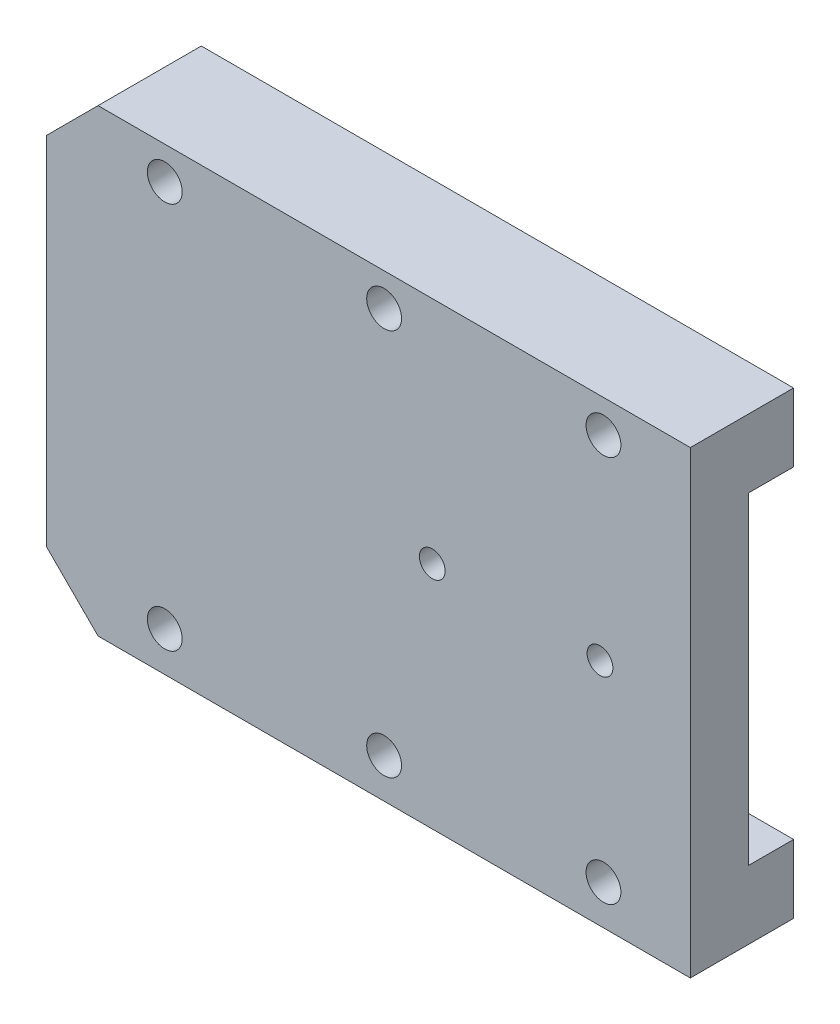
ISO-10303-21;
HEADER;
FILE_DESCRIPTION(('STEP AP214'),'2;1');
FILE_NAME('part.step','',(''),(''),'','','');
FILE_SCHEMA(('AUTOMOTIVE_DESIGN { 1 0 10303 214 1 1 1 1 }'));
ENDSEC;
DATA;
#1=APPLICATION_CONTEXT('core data for automotive mechanical design processes');
#2=APPLICATION_PROTOCOL_DEFINITION('international standard','automotive_design',2000,#1);
#3=PRODUCT_CONTEXT('',#1,'mechanical');
#4=PRODUCT('Part','Part','',(#3));
#5=PRODUCT_RELATED_PRODUCT_CATEGORY('part','',(#4));
#6=PRODUCT_DEFINITION_FORMATION('','',#4);
#7=PRODUCT_DEFINITION_CONTEXT('part definition',#1,'design');
#8=PRODUCT_DEFINITION('design','',#6,#7);
#9=PRODUCT_DEFINITION_SHAPE('','',#8);
#10=(LENGTH_UNIT() NAMED_UNIT(*) SI_UNIT(.MILLI.,.METRE.));
#11=(NAMED_UNIT(*) PLANE_ANGLE_UNIT() SI_UNIT($,.RADIAN.));
#12=(NAMED_UNIT(*) SI_UNIT($,.STERADIAN.) SOLID_ANGLE_UNIT());
#13=UNCERTAINTY_MEASURE_WITH_UNIT(LENGTH_MEASURE(1.E-05),#10,'distance_accuracy_value','');
#14=(GEOMETRIC_REPRESENTATION_CONTEXT(3) GLOBAL_UNCERTAINTY_ASSIGNED_CONTEXT((#13)) GLOBAL_UNIT_ASSIGNED_CONTEXT((#10,
#11,#12)) REPRESENTATION_CONTEXT('',''));
#15=CARTESIAN_POINT('',(0.,0.,0.));
#16=DIRECTION('',(0.,0.,1.));
#17=DIRECTION('',(1.,0.,0.));
#18=AXIS2_PLACEMENT_3D('',#15,#16,#17);
#19=CARTESIAN_POINT('',(0.,0.,-4.));
#20=DIRECTION('',(0.,0.,-1.));
#21=DIRECTION('',(-1.,0.,0.));
#22=AXIS2_PLACEMENT_3D('',#19,#20,#21);
#23=PLANE('',#22);
#24=DIRECTION('',(-1.,0.,0.));
#25=VECTOR('',#24,1.);
#26=CARTESIAN_POINT('',(22.5,12.5,-4.));
#27=LINE('',#26,#25);
#28=CARTESIAN_POINT('',(22.5,12.5,-4.));
#29=VERTEX_POINT('',#28);
#30=CARTESIAN_POINT('',(-27.4,12.5,-4.));
#31=VERTEX_POINT('',#30);
#32=EDGE_CURVE('E170',#29,#31,#27,.T.);
#33=ORIENTED_EDGE('',*,*,#32,.T.);
#34=DIRECTION('',(0.,1.,0.));
#35=VECTOR('',#34,1.);
#36=CARTESIAN_POINT('',(-27.4,17.8,-4.));
#37=LINE('',#36,#35);
#38=CARTESIAN_POINT('',(-27.4,13.8,-4.));
#39=VERTEX_POINT('',#38);
#40=EDGE_CURVE('E173',#31,#39,#37,.T.);
#41=ORIENTED_EDGE('',*,*,#40,.T.);
#42=DIRECTION('',(0.707106781186549,0.707106781186546,0.));
#43=VECTOR('',#42,1.);
#44=CARTESIAN_POINT('',(-20.6,20.6,-4.));
#45=LINE('',#44,#43);
#46=CARTESIAN_POINT('',(-23.4,17.8,-4.));
#47=VERTEX_POINT('',#46);
#48=EDGE_CURVE('E143',#39,#47,#45,.T.);
#49=ORIENTED_EDGE('',*,*,#48,.T.);
#50=DIRECTION('',(-1.,0.,0.));
#51=VECTOR('',#50,1.);
#52=CARTESIAN_POINT('',(22.5,17.8,-4.));
#53=LINE('',#52,#51);
#54=CARTESIAN_POINT('',(22.5,17.8,-4.));
#55=VERTEX_POINT('',#54);
#56=EDGE_CURVE('E121',#55,#47,#53,.T.);
#57=ORIENTED_EDGE('',*,*,#56,.F.);
#58=DIRECTION('',(0.,1.,0.));
#59=VECTOR('',#58,1.);
#60=CARTESIAN_POINT('',(22.5,17.8,-4.));
#61=LINE('',#60,#59);
#62=EDGE_CURVE('E122',#29,#55,#61,.T.);
#63=ORIENTED_EDGE('',*,*,#62,.F.);
#64=EDGE_LOOP('',(#33,#41,#49,#57,#63));
#65=FACE_BOUND('',#64,.T.);
#66=CARTESIAN_POINT('',(-18.2306151546301,15.26709885284,-4.));
#67=DIRECTION('',(0.,0.,-1.));
#68=DIRECTION('',(-1.,0.,0.));
#69=AXIS2_PLACEMENT_3D('',#66,#67,#68);
#70=CIRCLE('',#69,1.35);
#71=CARTESIAN_POINT('',(-19.5806151546301,15.26709885284,-4.));
#72=VERTEX_POINT('',#71);
#73=EDGE_CURVE('E190',#72,#72,#70,.T.);
#74=ORIENTED_EDGE('',*,*,#73,.F.);
#75=EDGE_LOOP('',(#74));
#76=FACE_BOUND('',#75,.T.);
#77=CARTESIAN_POINT('',(-1.23061515463011,15.2670988528399,-4.));
#78=DIRECTION('',(0.,0.,-1.));
#79=DIRECTION('',(-1.,0.,0.));
#80=AXIS2_PLACEMENT_3D('',#77,#78,#79);
#81=CIRCLE('',#80,1.35);
#82=CARTESIAN_POINT('',(-2.58061515463011,15.2670988528399,-4.));
#83=VERTEX_POINT('',#82);
#84=EDGE_CURVE('E184',#83,#83,#81,.T.);
#85=ORIENTED_EDGE('',*,*,#84,.F.);
#86=EDGE_LOOP('',(#85));
#87=FACE_BOUND('',#86,.T.);
#88=CARTESIAN_POINT('',(15.7693848453699,15.2670988528398,-4.));
#89=DIRECTION('',(0.,0.,-1.));
#90=DIRECTION('',(-1.,0.,0.));
#91=AXIS2_PLACEMENT_3D('',#88,#89,#90);
#92=CIRCLE('',#91,1.35);
#93=CARTESIAN_POINT('',(14.4193848453699,15.2670988528398,-4.));
#94=VERTEX_POINT('',#93);
#95=EDGE_CURVE('E179',#94,#94,#92,.T.);
#96=ORIENTED_EDGE('',*,*,#95,.F.);
#97=EDGE_LOOP('',(#96));
#98=FACE_BOUND('',#97,.T.);
#99=ADVANCED_FACE('F16',(#65,#76,#87,#98),#23,.T.);
#100=CARTESIAN_POINT('',(22.5,-17.8,4.));
#101=DIRECTION('',(0.,1.,0.));
#102=DIRECTION('',(-1.,0.,0.));
#103=AXIS2_PLACEMENT_3D('',#100,#101,#102);
#104=PLANE('',#103);
#105=DIRECTION('',(1.,0.,0.));
#106=VECTOR('',#105,1.);
#107=CARTESIAN_POINT('',(22.5,-17.8,4.));
#108=LINE('',#107,#106);
#109=CARTESIAN_POINT('',(-23.4,-17.8,4.));
#110=VERTEX_POINT('',#109);
#111=CARTESIAN_POINT('',(22.5,-17.8,4.));
#112=VERTEX_POINT('',#111);
#113=EDGE_CURVE('E125',#110,#112,#108,.T.);
#114=ORIENTED_EDGE('',*,*,#113,.F.);
#115=DIRECTION('',(0.,0.,-1.));
#116=VECTOR('',#115,1.);
#117=CARTESIAN_POINT('',(-23.4,-17.8,-4.));
#118=LINE('',#117,#116);
#119=CARTESIAN_POINT('',(-23.4,-17.8,-4.));
#120=VERTEX_POINT('',#119);
#121=EDGE_CURVE('E10',#110,#120,#118,.T.);
#122=ORIENTED_EDGE('',*,*,#121,.T.);
#123=DIRECTION('',(1.,0.,0.));
#124=VECTOR('',#123,1.);
#125=CARTESIAN_POINT('',(22.5,-17.8,-4.));
#126=LINE('',#125,#124);
#127=CARTESIAN_POINT('',(22.5,-17.8,-4.));
#128=VERTEX_POINT('',#127);
#129=EDGE_CURVE('E127',#120,#128,#126,.T.);
#130=ORIENTED_EDGE('',*,*,#129,.T.);
#131=DIRECTION('',(0.,0.,-1.));
#132=VECTOR('',#131,1.);
#133=CARTESIAN_POINT('',(22.5,-17.8,4.));
#134=LINE('',#133,#132);
#135=EDGE_CURVE('E120',#112,#128,#134,.T.);
#136=ORIENTED_EDGE('',*,*,#135,.F.);
#137=EDGE_LOOP('',(#114,#122,#130,#136));
#138=FACE_BOUND('',#137,.T.);
#139=ADVANCED_FACE('F238',(#138),#104,.F.);
#140=CARTESIAN_POINT('',(22.5,17.8,4.));
#141=DIRECTION('',(-1.,0.,0.));
#142=DIRECTION('',(0.,0.,1.));
#143=AXIS2_PLACEMENT_3D('',#140,#141,#142);
#144=PLANE('',#143);
#145=DIRECTION('',(0.,1.,0.));
#146=VECTOR('',#145,1.);
#147=CARTESIAN_POINT('',(22.5,12.5,-0.5));
#148=LINE('',#147,#146);
#149=CARTESIAN_POINT('',(22.5,-12.5,-0.5));
#150=VERTEX_POINT('',#149);
#151=CARTESIAN_POINT('',(22.5,12.5,-0.5));
#152=VERTEX_POINT('',#151);
#153=EDGE_CURVE('E102',#150,#152,#148,.T.);
#154=ORIENTED_EDGE('',*,*,#153,.T.);
#155=DIRECTION('',(0.,0.,-1.));
#156=VECTOR('',#155,1.);
#157=CARTESIAN_POINT('',(22.5,12.5,-0.5));
#158=LINE('',#157,#156);
#159=EDGE_CURVE('E114',#152,#29,#158,.T.);
#160=ORIENTED_EDGE('',*,*,#159,.T.);
#161=ORIENTED_EDGE('',*,*,#62,.T.);
#162=DIRECTION('',(0.,0.,-1.));
#163=VECTOR('',#162,1.);
#164=CARTESIAN_POINT('',(22.5,17.8,4.));
#165=LINE('',#164,#163);
#166=CARTESIAN_POINT('',(22.5,17.8,4.));
#167=VERTEX_POINT('',#166);
#168=EDGE_CURVE('E131',#167,#55,#165,.T.);
#169=ORIENTED_EDGE('',*,*,#168,.F.);
#170=DIRECTION('',(0.,1.,0.));
#171=VECTOR('',#170,1.);
#172=CARTESIAN_POINT('',(22.5,17.8,4.));
#173=LINE('',#172,#171);
#174=EDGE_CURVE('E217',#112,#167,#173,.T.);
#175=ORIENTED_EDGE('',*,*,#174,.F.);
#176=ORIENTED_EDGE('',*,*,#135,.T.);
#177=CARTESIAN_POINT('',(22.5,-12.5,-4.));
#178=VERTEX_POINT('',#177);
#179=EDGE_CURVE('E111',#128,#178,#61,.T.);
#180=ORIENTED_EDGE('',*,*,#179,.T.);
#181=DIRECTION('',(0.,0.,1.));
#182=VECTOR('',#181,1.);
#183=CARTESIAN_POINT('',(22.5,-12.5,-0.5));
#184=LINE('',#183,#182);
#185=EDGE_CURVE('E95',#178,#150,#184,.T.);
#186=ORIENTED_EDGE('',*,*,#185,.T.);
#187=EDGE_LOOP('',(#154,#160,#161,#169,#175,#176,#180,#186));
#188=FACE_BOUND('',#187,.T.);
#189=ADVANCED_FACE('F117',(#188),#144,.F.);
#190=CARTESIAN_POINT('',(22.5,17.8,4.));
#191=DIRECTION('',(0.,-1.,0.));
#192=DIRECTION('',(1.,0.,0.));
#193=AXIS2_PLACEMENT_3D('',#190,#191,#192);
#194=PLANE('',#193);
#195=ORIENTED_EDGE('',*,*,#56,.T.);
#196=DIRECTION('',(0.,0.,1.));
#197=VECTOR('',#196,1.);
#198=CARTESIAN_POINT('',(-23.4,17.8,4.));
#199=LINE('',#198,#197);
#200=CARTESIAN_POINT('',(-23.4,17.8,4.));
#201=VERTEX_POINT('',#200);
#202=EDGE_CURVE('E145',#47,#201,#199,.T.);
#203=ORIENTED_EDGE('',*,*,#202,.T.);
#204=DIRECTION('',(-1.,0.,0.));
#205=VECTOR('',#204,1.);
#206=CARTESIAN_POINT('',(22.5,17.8,4.));
#207=LINE('',#206,#205);
#208=EDGE_CURVE('E134',#167,#201,#207,.T.);
#209=ORIENTED_EDGE('',*,*,#208,.F.);
#210=ORIENTED_EDGE('',*,*,#168,.T.);
#211=EDGE_LOOP('',(#195,#203,#209,#210));
#212=FACE_BOUND('',#211,.T.);
#213=ADVANCED_FACE('F248',(#212),#194,.F.);
#214=CARTESIAN_POINT('',(0.,0.,4.));
#215=DIRECTION('',(0.,0.,-1.));
#216=DIRECTION('',(-1.,0.,0.));
#217=AXIS2_PLACEMENT_3D('',#214,#215,#216);
#218=PLANE('',#217);
#219=CARTESIAN_POINT('',(15.5,0.,4.));
#220=DIRECTION('',(0.,0.,1.));
#221=DIRECTION('',(1.,0.,0.));
#222=AXIS2_PLACEMENT_3D('',#219,#220,#221);
#223=CIRCLE('',#222,1.);
#224=CARTESIAN_POINT('',(16.5,0.,4.));
#225=VERTEX_POINT('',#224);
#226=EDGE_CURVE('E161',#225,#225,#223,.T.);
#227=ORIENTED_EDGE('',*,*,#226,.F.);
#228=EDGE_LOOP('',(#227));
#229=FACE_BOUND('',#228,.T.);
#230=CARTESIAN_POINT('',(2.5,0.,4.));
#231=DIRECTION('',(0.,0.,1.));
#232=DIRECTION('',(1.,0.,0.));
#233=AXIS2_PLACEMENT_3D('',#230,#231,#232);
#234=CIRCLE('',#233,1.);
#235=CARTESIAN_POINT('',(3.5,0.,4.));
#236=VERTEX_POINT('',#235);
#237=EDGE_CURVE('E151',#236,#236,#234,.T.);
#238=ORIENTED_EDGE('',*,*,#237,.F.);
#239=EDGE_LOOP('',(#238));
#240=FACE_BOUND('',#239,.T.);
#241=CARTESIAN_POINT('',(15.7693848453699,15.2670988528398,4.));
#242=DIRECTION('',(0.,0.,-1.));
#243=DIRECTION('',(-1.,0.,0.));
#244=AXIS2_PLACEMENT_3D('',#241,#242,#243);
#245=CIRCLE('',#244,1.35);
#246=CARTESIAN_POINT('',(14.4193848453699,15.2670988528398,4.));
#247=VERTEX_POINT('',#246);
#248=EDGE_CURVE('E181',#247,#247,#245,.T.);
#249=ORIENTED_EDGE('',*,*,#248,.T.);
#250=EDGE_LOOP('',(#249));
#251=FACE_BOUND('',#250,.T.);
#252=CARTESIAN_POINT('',(-1.23061515463011,15.2670988528399,4.));
#253=DIRECTION('',(0.,0.,-1.));
#254=DIRECTION('',(-1.,0.,0.));
#255=AXIS2_PLACEMENT_3D('',#252,#253,#254);
#256=CIRCLE('',#255,1.35);
#257=CARTESIAN_POINT('',(-2.58061515463011,15.2670988528399,4.));
#258=VERTEX_POINT('',#257);
#259=EDGE_CURVE('E187',#258,#258,#256,.T.);
#260=ORIENTED_EDGE('',*,*,#259,.T.);
#261=EDGE_LOOP('',(#260));
#262=FACE_BOUND('',#261,.T.);
#263=CARTESIAN_POINT('',(-18.2306151546301,15.26709885284,4.));
#264=DIRECTION('',(0.,0.,-1.));
#265=DIRECTION('',(-1.,0.,0.));
#266=AXIS2_PLACEMENT_3D('',#263,#264,#265);
#267=CIRCLE('',#266,1.35);
#268=CARTESIAN_POINT('',(-19.5806151546301,15.26709885284,4.));
#269=VERTEX_POINT('',#268);
#270=EDGE_CURVE('E193',#269,#269,#267,.T.);
#271=ORIENTED_EDGE('',*,*,#270,.T.);
#272=EDGE_LOOP('',(#271));
#273=FACE_BOUND('',#272,.T.);
#274=CARTESIAN_POINT('',(-18.2306151546302,-14.7329011471601,4.));
#275=DIRECTION('',(0.,0.,-1.));
#276=DIRECTION('',(-1.,0.,0.));
#277=AXIS2_PLACEMENT_3D('',#274,#275,#276);
#278=CIRCLE('',#277,1.35);
#279=CARTESIAN_POINT('',(-19.5806151546302,-14.7329011471601,4.));
#280=VERTEX_POINT('',#279);
#281=EDGE_CURVE('E199',#280,#280,#278,.T.);
#282=ORIENTED_EDGE('',*,*,#281,.T.);
#283=EDGE_LOOP('',(#282));
#284=FACE_BOUND('',#283,.T.);
#285=CARTESIAN_POINT('',(-1.23061515463022,-14.7329011471601,4.));
#286=DIRECTION('',(0.,0.,-1.));
#287=DIRECTION('',(-1.,0.,0.));
#288=AXIS2_PLACEMENT_3D('',#285,#286,#287);
#289=CIRCLE('',#288,1.35);
#290=CARTESIAN_POINT('',(-2.58061515463022,-14.7329011471601,4.));
#291=VERTEX_POINT('',#290);
#292=EDGE_CURVE('E205',#291,#291,#289,.T.);
#293=ORIENTED_EDGE('',*,*,#292,.T.);
#294=EDGE_LOOP('',(#293));
#295=FACE_BOUND('',#294,.T.);
#296=CARTESIAN_POINT('',(15.7693848453698,-14.7329011471602,4.));
#297=DIRECTION('',(0.,0.,-1.));
#298=DIRECTION('',(-1.,0.,0.));
#299=AXIS2_PLACEMENT_3D('',#296,#297,#298);
#300=CIRCLE('',#299,1.35);
#301=CARTESIAN_POINT('',(14.4193848453698,-14.7329011471602,4.));
#302=VERTEX_POINT('',#301);
#303=EDGE_CURVE('E211',#302,#302,#300,.T.);
#304=ORIENTED_EDGE('',*,*,#303,.T.);
#305=EDGE_LOOP('',(#304));
#306=FACE_BOUND('',#305,.T.);
#307=ORIENTED_EDGE('',*,*,#208,.T.);
#308=DIRECTION('',(-0.707106781186549,-0.707106781186546,0.));
#309=VECTOR('',#308,1.);
#310=CARTESIAN_POINT('',(-27.4,13.8,4.));
#311=LINE('',#310,#309);
#312=CARTESIAN_POINT('',(-27.4,13.8,4.));
#313=VERTEX_POINT('',#312);
#314=EDGE_CURVE('E25',#201,#313,#311,.T.);
#315=ORIENTED_EDGE('',*,*,#314,.T.);
#316=DIRECTION('',(0.,-1.,0.));
#317=VECTOR('',#316,1.);
#318=CARTESIAN_POINT('',(-27.4,17.8,4.));
#319=LINE('',#318,#317);
#320=CARTESIAN_POINT('',(-27.4,-13.8,4.));
#321=VERTEX_POINT('',#320);
#322=EDGE_CURVE('E177',#313,#321,#319,.T.);
#323=ORIENTED_EDGE('',*,*,#322,.T.);
#324=DIRECTION('',(0.707106781186547,-0.707106781186548,0.));
#325=VECTOR('',#324,1.);
#326=CARTESIAN_POINT('',(-23.4,-17.8,4.));
#327=LINE('',#326,#325);
#328=EDGE_CURVE('E41',#321,#110,#327,.T.);
#329=ORIENTED_EDGE('',*,*,#328,.T.);
#330=ORIENTED_EDGE('',*,*,#113,.T.);
#331=ORIENTED_EDGE('',*,*,#174,.T.);
#332=EDGE_LOOP('',(#307,#315,#323,#329,#330,#331));
#333=FACE_BOUND('',#332,.T.);
#334=ADVANCED_FACE('F221',(#229,#240,#251,#262,#273,#284,#295,#306,#333),#218,.F.);
#335=DIRECTION('',(-1.,0.,0.));
#336=VECTOR('',#335,1.);
#337=CARTESIAN_POINT('',(22.5,-12.5,-4.));
#338=LINE('',#337,#336);
#339=CARTESIAN_POINT('',(-27.4,-12.5,-4.));
#340=VERTEX_POINT('',#339);
#341=EDGE_CURVE('E33',#178,#340,#338,.T.);
#342=ORIENTED_EDGE('',*,*,#341,.F.);
#343=ORIENTED_EDGE('',*,*,#179,.F.);
#344=ORIENTED_EDGE('',*,*,#129,.F.);
#345=DIRECTION('',(-0.707106781186547,0.707106781186548,0.));
#346=VECTOR('',#345,1.);
#347=CARTESIAN_POINT('',(-20.6,-20.6,-4.));
#348=LINE('',#347,#346);
#349=CARTESIAN_POINT('',(-27.4,-13.8,-4.));
#350=VERTEX_POINT('',#349);
#351=EDGE_CURVE('E141',#120,#350,#348,.T.);
#352=ORIENTED_EDGE('',*,*,#351,.T.);
#353=EDGE_CURVE('E113',#350,#340,#37,.T.);
#354=ORIENTED_EDGE('',*,*,#353,.T.);
#355=EDGE_LOOP('',(#342,#343,#344,#352,#354));
#356=FACE_BOUND('',#355,.T.);
#357=CARTESIAN_POINT('',(-18.2306151546302,-14.7329011471601,-4.));
#358=DIRECTION('',(0.,0.,-1.));
#359=DIRECTION('',(-1.,0.,0.));
#360=AXIS2_PLACEMENT_3D('',#357,#358,#359);
#361=CIRCLE('',#360,1.35);
#362=CARTESIAN_POINT('',(-19.5806151546302,-14.7329011471601,-4.));
#363=VERTEX_POINT('',#362);
#364=EDGE_CURVE('E196',#363,#363,#361,.T.);
#365=ORIENTED_EDGE('',*,*,#364,.F.);
#366=EDGE_LOOP('',(#365));
#367=FACE_BOUND('',#366,.T.);
#368=CARTESIAN_POINT('',(-1.23061515463022,-14.7329011471601,-4.));
#369=DIRECTION('',(0.,0.,-1.));
#370=DIRECTION('',(-1.,0.,0.));
#371=AXIS2_PLACEMENT_3D('',#368,#369,#370);
#372=CIRCLE('',#371,1.35);
#373=CARTESIAN_POINT('',(-2.58061515463022,-14.7329011471601,-4.));
#374=VERTEX_POINT('',#373);
#375=EDGE_CURVE('E202',#374,#374,#372,.T.);
#376=ORIENTED_EDGE('',*,*,#375,.F.);
#377=EDGE_LOOP('',(#376));
#378=FACE_BOUND('',#377,.T.);
#379=CARTESIAN_POINT('',(15.7693848453698,-14.7329011471602,-4.));
#380=DIRECTION('',(0.,0.,-1.));
#381=DIRECTION('',(-1.,0.,0.));
#382=AXIS2_PLACEMENT_3D('',#379,#380,#381);
#383=CIRCLE('',#382,1.35);
#384=CARTESIAN_POINT('',(14.4193848453698,-14.7329011471602,-4.));
#385=VERTEX_POINT('',#384);
#386=EDGE_CURVE('E208',#385,#385,#383,.T.);
#387=ORIENTED_EDGE('',*,*,#386,.F.);
#388=EDGE_LOOP('',(#387));
#389=FACE_BOUND('',#388,.T.);
#390=ADVANCED_FACE('F108',(#356,#367,#378,#389),#23,.T.);
#391=CARTESIAN_POINT('',(15.7693848453698,-14.7329011471602,4.));
#392=DIRECTION('',(0.,0.,-1.));
#393=DIRECTION('',(-1.,0.,0.));
#394=AXIS2_PLACEMENT_3D('',#391,#392,#393);
#395=CYLINDRICAL_SURFACE('',#394,1.35);
#396=ORIENTED_EDGE('',*,*,#303,.F.);
#397=EDGE_LOOP('',(#396));
#398=FACE_BOUND('',#397,.T.);
#399=ORIENTED_EDGE('',*,*,#386,.T.);
#400=EDGE_LOOP('',(#399));
#401=FACE_BOUND('',#400,.T.);
#402=ADVANCED_FACE('F268',(#398,#401),#395,.F.);
#403=CARTESIAN_POINT('',(-1.23061515463022,-14.7329011471601,4.));
#404=DIRECTION('',(0.,0.,-1.));
#405=DIRECTION('',(-1.,0.,0.));
#406=AXIS2_PLACEMENT_3D('',#403,#404,#405);
#407=CYLINDRICAL_SURFACE('',#406,1.35);
#408=ORIENTED_EDGE('',*,*,#292,.F.);
#409=EDGE_LOOP('',(#408));
#410=FACE_BOUND('',#409,.T.);
#411=ORIENTED_EDGE('',*,*,#375,.T.);
#412=EDGE_LOOP('',(#411));
#413=FACE_BOUND('',#412,.T.);
#414=ADVANCED_FACE('F273',(#410,#413),#407,.F.);
#415=CARTESIAN_POINT('',(-18.2306151546302,-14.7329011471601,4.));
#416=DIRECTION('',(0.,0.,-1.));
#417=DIRECTION('',(-1.,0.,0.));
#418=AXIS2_PLACEMENT_3D('',#415,#416,#417);
#419=CYLINDRICAL_SURFACE('',#418,1.35);
#420=ORIENTED_EDGE('',*,*,#281,.F.);
#421=EDGE_LOOP('',(#420));
#422=FACE_BOUND('',#421,.T.);
#423=ORIENTED_EDGE('',*,*,#364,.T.);
#424=EDGE_LOOP('',(#423));
#425=FACE_BOUND('',#424,.T.);
#426=ADVANCED_FACE('F280',(#422,#425),#419,.F.);
#427=CARTESIAN_POINT('',(-18.2306151546301,15.26709885284,4.));
#428=DIRECTION('',(0.,0.,-1.));
#429=DIRECTION('',(-1.,0.,0.));
#430=AXIS2_PLACEMENT_3D('',#427,#428,#429);
#431=CYLINDRICAL_SURFACE('',#430,1.35);
#432=ORIENTED_EDGE('',*,*,#270,.F.);
#433=EDGE_LOOP('',(#432));
#434=FACE_BOUND('',#433,.T.);
#435=ORIENTED_EDGE('',*,*,#73,.T.);
#436=EDGE_LOOP('',(#435));
#437=FACE_BOUND('',#436,.T.);
#438=ADVANCED_FACE('F288',(#434,#437),#431,.F.);
#439=CARTESIAN_POINT('',(-1.23061515463011,15.2670988528399,4.));
#440=DIRECTION('',(0.,0.,-1.));
#441=DIRECTION('',(-1.,0.,0.));
#442=AXIS2_PLACEMENT_3D('',#439,#440,#441);
#443=CYLINDRICAL_SURFACE('',#442,1.35);
#444=ORIENTED_EDGE('',*,*,#259,.F.);
#445=EDGE_LOOP('',(#444));
#446=FACE_BOUND('',#445,.T.);
#447=ORIENTED_EDGE('',*,*,#84,.T.);
#448=EDGE_LOOP('',(#447));
#449=FACE_BOUND('',#448,.T.);
#450=ADVANCED_FACE('F292',(#446,#449),#443,.F.);
#451=CARTESIAN_POINT('',(15.7693848453699,15.2670988528398,4.));
#452=DIRECTION('',(0.,0.,-1.));
#453=DIRECTION('',(-1.,0.,0.));
#454=AXIS2_PLACEMENT_3D('',#451,#452,#453);
#455=CYLINDRICAL_SURFACE('',#454,1.35);
#456=ORIENTED_EDGE('',*,*,#248,.F.);
#457=EDGE_LOOP('',(#456));
#458=FACE_BOUND('',#457,.T.);
#459=ORIENTED_EDGE('',*,*,#95,.T.);
#460=EDGE_LOOP('',(#459));
#461=FACE_BOUND('',#460,.T.);
#462=ADVANCED_FACE('F296',(#458,#461),#455,.F.);
#463=CARTESIAN_POINT('',(-27.4,17.8,39.9356369082281));
#464=DIRECTION('',(-1.,0.,0.));
#465=DIRECTION('',(0.,-1.,0.));
#466=AXIS2_PLACEMENT_3D('',#463,#464,#465);
#467=PLANE('',#466);
#468=DIRECTION('',(0.,0.,-1.));
#469=VECTOR('',#468,1.);
#470=CARTESIAN_POINT('',(-27.4,12.5,-0.5));
#471=LINE('',#470,#469);
#472=CARTESIAN_POINT('',(-27.4,12.5,-0.5));
#473=VERTEX_POINT('',#472);
#474=EDGE_CURVE('E103',#473,#31,#471,.T.);
#475=ORIENTED_EDGE('',*,*,#474,.F.);
#476=DIRECTION('',(0.,1.,0.));
#477=VECTOR('',#476,1.);
#478=CARTESIAN_POINT('',(-27.4,12.5,-0.5));
#479=LINE('',#478,#477);
#480=CARTESIAN_POINT('',(-27.4,-12.5,-0.5));
#481=VERTEX_POINT('',#480);
#482=EDGE_CURVE('E154',#481,#473,#479,.T.);
#483=ORIENTED_EDGE('',*,*,#482,.F.);
#484=DIRECTION('',(0.,0.,1.));
#485=VECTOR('',#484,1.);
#486=CARTESIAN_POINT('',(-27.4,-12.5,-0.5));
#487=LINE('',#486,#485);
#488=EDGE_CURVE('E150',#340,#481,#487,.T.);
#489=ORIENTED_EDGE('',*,*,#488,.F.);
#490=ORIENTED_EDGE('',*,*,#353,.F.);
#491=DIRECTION('',(0.,0.,1.));
#492=VECTOR('',#491,1.);
#493=CARTESIAN_POINT('',(-27.4,-13.8,4.));
#494=LINE('',#493,#492);
#495=EDGE_CURVE('E136',#350,#321,#494,.T.);
#496=ORIENTED_EDGE('',*,*,#495,.T.);
#497=ORIENTED_EDGE('',*,*,#322,.F.);
#498=DIRECTION('',(0.,0.,-1.));
#499=VECTOR('',#498,1.);
#500=CARTESIAN_POINT('',(-27.4,13.8,-4.));
#501=LINE('',#500,#499);
#502=EDGE_CURVE('E138',#313,#39,#501,.T.);
#503=ORIENTED_EDGE('',*,*,#502,.T.);
#504=ORIENTED_EDGE('',*,*,#40,.F.);
#505=EDGE_LOOP('',(#475,#483,#489,#490,#496,#497,#503,#504));
#506=FACE_BOUND('',#505,.T.);
#507=ADVANCED_FACE('F233',(#506),#467,.T.);
#508=CARTESIAN_POINT('',(-27.4,13.8,39.9356369082281));
#509=DIRECTION('',(-0.707106781186546,0.707106781186549,0.));
#510=DIRECTION('',(0.,0.,1.));
#511=AXIS2_PLACEMENT_3D('',#508,#509,#510);
#512=PLANE('',#511);
#513=ORIENTED_EDGE('',*,*,#314,.F.);
#514=ORIENTED_EDGE('',*,*,#202,.F.);
#515=ORIENTED_EDGE('',*,*,#48,.F.);
#516=ORIENTED_EDGE('',*,*,#502,.F.);
#517=EDGE_LOOP('',(#513,#514,#515,#516));
#518=FACE_BOUND('',#517,.T.);
#519=ADVANCED_FACE('F228',(#518),#512,.T.);
#520=CARTESIAN_POINT('',(-23.4,-17.8,4.));
#521=DIRECTION('',(-0.707106781186548,-0.707106781186547,0.));
#522=DIRECTION('',(0.,0.,1.));
#523=AXIS2_PLACEMENT_3D('',#520,#521,#522);
#524=PLANE('',#523);
#525=ORIENTED_EDGE('',*,*,#328,.F.);
#526=ORIENTED_EDGE('',*,*,#495,.F.);
#527=ORIENTED_EDGE('',*,*,#351,.F.);
#528=ORIENTED_EDGE('',*,*,#121,.F.);
#529=EDGE_LOOP('',(#525,#526,#527,#528));
#530=FACE_BOUND('',#529,.T.);
#531=ADVANCED_FACE('F18',(#530),#524,.T.);
#532=CARTESIAN_POINT('',(22.5,12.5,-0.5));
#533=DIRECTION('',(0.,1.,0.));
#534=DIRECTION('',(-1.,0.,0.));
#535=AXIS2_PLACEMENT_3D('',#532,#533,#534);
#536=PLANE('',#535);
#537=ORIENTED_EDGE('',*,*,#474,.T.);
#538=ORIENTED_EDGE('',*,*,#32,.F.);
#539=ORIENTED_EDGE('',*,*,#159,.F.);
#540=DIRECTION('',(-1.,0.,0.));
#541=VECTOR('',#540,1.);
#542=CARTESIAN_POINT('',(22.5,12.5,-0.5));
#543=LINE('',#542,#541);
#544=EDGE_CURVE('E174',#152,#473,#543,.T.);
#545=ORIENTED_EDGE('',*,*,#544,.T.);
#546=EDGE_LOOP('',(#537,#538,#539,#545));
#547=FACE_BOUND('',#546,.T.);
#548=ADVANCED_FACE('F308',(#547),#536,.F.);
#549=CARTESIAN_POINT('',(22.5,12.5,-0.5));
#550=DIRECTION('',(0.,0.,1.));
#551=DIRECTION('',(0.,-1.,0.));
#552=AXIS2_PLACEMENT_3D('',#549,#550,#551);
#553=PLANE('',#552);
#554=CARTESIAN_POINT('',(15.5,0.,-0.5));
#555=DIRECTION('',(0.,0.,1.));
#556=DIRECTION('',(0.,-1.,0.));
#557=AXIS2_PLACEMENT_3D('',#554,#555,#556);
#558=CIRCLE('',#557,1.);
#559=CARTESIAN_POINT('',(15.5,-1.,-0.5));
#560=VERTEX_POINT('',#559);
#561=EDGE_CURVE('E20',#560,#560,#558,.T.);
#562=ORIENTED_EDGE('',*,*,#561,.T.);
#563=EDGE_LOOP('',(#562));
#564=FACE_BOUND('',#563,.T.);
#565=CARTESIAN_POINT('',(2.5,0.,-0.5));
#566=DIRECTION('',(0.,0.,1.));
#567=DIRECTION('',(0.,-1.,0.));
#568=AXIS2_PLACEMENT_3D('',#565,#566,#567);
#569=CIRCLE('',#568,1.);
#570=CARTESIAN_POINT('',(2.5,-1.,-0.5));
#571=VERTEX_POINT('',#570);
#572=EDGE_CURVE('E148',#571,#571,#569,.T.);
#573=ORIENTED_EDGE('',*,*,#572,.T.);
#574=EDGE_LOOP('',(#573));
#575=FACE_BOUND('',#574,.T.);
#576=ORIENTED_EDGE('',*,*,#482,.T.);
#577=ORIENTED_EDGE('',*,*,#544,.F.);
#578=ORIENTED_EDGE('',*,*,#153,.F.);
#579=DIRECTION('',(-1.,0.,0.));
#580=VECTOR('',#579,1.);
#581=CARTESIAN_POINT('',(22.5,-12.5,-0.5));
#582=LINE('',#581,#580);
#583=EDGE_CURVE('E97',#150,#481,#582,.T.);
#584=ORIENTED_EDGE('',*,*,#583,.T.);
#585=EDGE_LOOP('',(#576,#577,#578,#584));
#586=FACE_BOUND('',#585,.T.);
#587=ADVANCED_FACE('F241',(#564,#575,#586),#553,.F.);
#588=CARTESIAN_POINT('',(22.5,-12.5,-0.5));
#589=DIRECTION('',(0.,-1.,0.));
#590=DIRECTION('',(1.,0.,0.));
#591=AXIS2_PLACEMENT_3D('',#588,#589,#590);
#592=PLANE('',#591);
#593=ORIENTED_EDGE('',*,*,#488,.T.);
#594=ORIENTED_EDGE('',*,*,#583,.F.);
#595=ORIENTED_EDGE('',*,*,#185,.F.);
#596=ORIENTED_EDGE('',*,*,#341,.T.);
#597=EDGE_LOOP('',(#593,#594,#595,#596));
#598=FACE_BOUND('',#597,.T.);
#599=ADVANCED_FACE('F96',(#598),#592,.F.);
#600=CARTESIAN_POINT('',(2.5,0.,-4.));
#601=DIRECTION('',(0.,0.,1.));
#602=DIRECTION('',(1.,0.,0.));
#603=AXIS2_PLACEMENT_3D('',#600,#601,#602);
#604=CYLINDRICAL_SURFACE('',#603,1.);
#605=ORIENTED_EDGE('',*,*,#237,.T.);
#606=EDGE_LOOP('',(#605));
#607=FACE_BOUND('',#606,.T.);
#608=ORIENTED_EDGE('',*,*,#572,.F.);
#609=EDGE_LOOP('',(#608));
#610=FACE_BOUND('',#609,.T.);
#611=ADVANCED_FACE('F305',(#607,#610),#604,.F.);
#612=CARTESIAN_POINT('',(15.5,0.,-4.));
#613=DIRECTION('',(0.,0.,1.));
#614=DIRECTION('',(1.,0.,0.));
#615=AXIS2_PLACEMENT_3D('',#612,#613,#614);
#616=CYLINDRICAL_SURFACE('',#615,1.);
#617=ORIENTED_EDGE('',*,*,#226,.T.);
#618=EDGE_LOOP('',(#617));
#619=FACE_BOUND('',#618,.T.);
#620=ORIENTED_EDGE('',*,*,#561,.F.);
#621=EDGE_LOOP('',(#620));
#622=FACE_BOUND('',#621,.T.);
#623=ADVANCED_FACE('F314',(#619,#622),#616,.F.);
#624=CLOSED_SHELL('',(#99,#139,#189,#213,#334,#390,#402,#414,#426,#438,#450,#462,#507,#519,#531,
#548,#587,#599,#611,#623));
#625=MANIFOLD_SOLID_BREP('B1',#624);
#626=ADVANCED_BREP_SHAPE_REPRESENTATION('',(#18,#625),#14);
#627=SHAPE_DEFINITION_REPRESENTATION(#9,#626);
ENDSEC;
END-ISO-10303-21;
